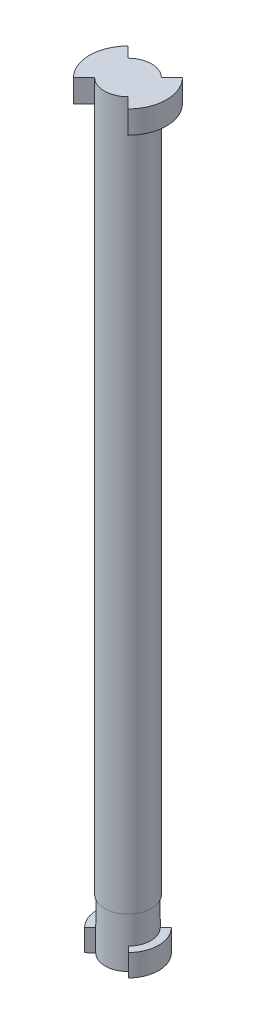
ISO-10303-21;
HEADER;
FILE_DESCRIPTION(('STEP AP214'),'2;1');
FILE_NAME('part.step','',(''),(''),'','','');
FILE_SCHEMA(('AUTOMOTIVE_DESIGN { 1 0 10303 214 1 1 1 1 }'));
ENDSEC;
DATA;
#1=APPLICATION_CONTEXT('core data for automotive mechanical design processes');
#2=APPLICATION_PROTOCOL_DEFINITION('international standard','automotive_design',2000,#1);
#3=PRODUCT_CONTEXT('',#1,'mechanical');
#4=PRODUCT('Part','Part','',(#3));
#5=PRODUCT_RELATED_PRODUCT_CATEGORY('part','',(#4));
#6=PRODUCT_DEFINITION_FORMATION('','',#4);
#7=PRODUCT_DEFINITION_CONTEXT('part definition',#1,'design');
#8=PRODUCT_DEFINITION('design','',#6,#7);
#9=PRODUCT_DEFINITION_SHAPE('','',#8);
#10=(LENGTH_UNIT() NAMED_UNIT(*) SI_UNIT(.MILLI.,.METRE.));
#11=(NAMED_UNIT(*) PLANE_ANGLE_UNIT() SI_UNIT($,.RADIAN.));
#12=(NAMED_UNIT(*) SI_UNIT($,.STERADIAN.) SOLID_ANGLE_UNIT());
#13=UNCERTAINTY_MEASURE_WITH_UNIT(LENGTH_MEASURE(1.E-05),#10,'distance_accuracy_value','');
#14=(GEOMETRIC_REPRESENTATION_CONTEXT(3) GLOBAL_UNCERTAINTY_ASSIGNED_CONTEXT((#13)) GLOBAL_UNIT_ASSIGNED_CONTEXT((#10,
#11,#12)) REPRESENTATION_CONTEXT('',''));
#15=CARTESIAN_POINT('',(0.,0.,0.));
#16=DIRECTION('',(0.,0.,1.));
#17=DIRECTION('',(1.,0.,0.));
#18=AXIS2_PLACEMENT_3D('',#15,#16,#17);
#19=CARTESIAN_POINT('',(0.,0.,0.));
#20=DIRECTION('',(0.,-1.,0.));
#21=DIRECTION('',(0.,0.,-1.));
#22=AXIS2_PLACEMENT_3D('',#19,#20,#21);
#23=CYLINDRICAL_SURFACE('',#22,3.81);
#24=CARTESIAN_POINT('',(0.,0.,0.));
#25=DIRECTION('',(0.,-1.,0.));
#26=DIRECTION('',(0.,0.,-1.));
#27=AXIS2_PLACEMENT_3D('',#24,#25,#26);
#28=CIRCLE('',#27,3.81);
#29=CARTESIAN_POINT('',(0.,0.,-3.81));
#30=VERTEX_POINT('',#29);
#31=EDGE_CURVE('E284',#30,#30,#28,.T.);
#32=ORIENTED_EDGE('',*,*,#31,.F.);
#33=EDGE_LOOP('',(#32));
#34=FACE_BOUND('',#33,.T.);
#35=CARTESIAN_POINT('',(0.,114.3,0.));
#36=DIRECTION('',(0.,-1.,0.));
#37=DIRECTION('',(0.,0.,-1.));
#38=AXIS2_PLACEMENT_3D('',#35,#36,#37);
#39=CIRCLE('',#38,3.81);
#40=CARTESIAN_POINT('',(-2.69407683632074,114.3,-2.69407683632075));
#41=VERTEX_POINT('',#40);
#42=CARTESIAN_POINT('',(2.69407683632074,114.3,-2.69407683632075));
#43=VERTEX_POINT('',#42);
#44=EDGE_CURVE('E292',#41,#43,#39,.T.);
#45=ORIENTED_EDGE('',*,*,#44,.T.);
#46=DIRECTION('',(0.,1.,0.));
#47=VECTOR('',#46,1.);
#48=CARTESIAN_POINT('',(2.69407683632074,0.,-2.69407683632075));
#49=LINE('',#48,#47);
#50=CARTESIAN_POINT('',(2.69407683632074,110.617,-2.69407683632075));
#51=VERTEX_POINT('',#50);
#52=EDGE_CURVE('E57',#51,#43,#49,.T.);
#53=ORIENTED_EDGE('',*,*,#52,.F.);
#54=CARTESIAN_POINT('',(0.,110.617,0.));
#55=DIRECTION('',(0.,-1.,0.));
#56=DIRECTION('',(0.,0.,-1.));
#57=AXIS2_PLACEMENT_3D('',#54,#55,#56);
#58=CIRCLE('',#57,3.81);
#59=CARTESIAN_POINT('',(2.69407683632074,110.617,2.69407683632075));
#60=VERTEX_POINT('',#59);
#61=EDGE_CURVE('E61',#51,#60,#58,.T.);
#62=ORIENTED_EDGE('',*,*,#61,.T.);
#63=DIRECTION('',(0.,1.,0.));
#64=VECTOR('',#63,1.);
#65=CARTESIAN_POINT('',(2.69407683632074,0.,2.69407683632075));
#66=LINE('',#65,#64);
#67=CARTESIAN_POINT('',(2.69407683632074,114.3,2.69407683632075));
#68=VERTEX_POINT('',#67);
#69=EDGE_CURVE('E180',#60,#68,#66,.T.);
#70=ORIENTED_EDGE('',*,*,#69,.T.);
#71=CARTESIAN_POINT('',(-2.69407683632074,114.3,2.69407683632075));
#72=VERTEX_POINT('',#71);
#73=EDGE_CURVE('E178',#68,#72,#39,.T.);
#74=ORIENTED_EDGE('',*,*,#73,.T.);
#75=DIRECTION('',(0.,1.,0.));
#76=VECTOR('',#75,1.);
#77=CARTESIAN_POINT('',(-2.69407683632074,0.,2.69407683632075));
#78=LINE('',#77,#76);
#79=CARTESIAN_POINT('',(-2.69407683632074,110.617,2.69407683632075));
#80=VERTEX_POINT('',#79);
#81=EDGE_CURVE('E218',#80,#72,#78,.T.);
#82=ORIENTED_EDGE('',*,*,#81,.F.);
#83=CARTESIAN_POINT('',(0.,110.617,0.));
#84=DIRECTION('',(0.,-1.,0.));
#85=DIRECTION('',(0.,0.,-1.));
#86=AXIS2_PLACEMENT_3D('',#83,#84,#85);
#87=CIRCLE('',#86,3.81);
#88=CARTESIAN_POINT('',(-2.69407683632074,110.617,-2.69407683632075));
#89=VERTEX_POINT('',#88);
#90=EDGE_CURVE('E234',#80,#89,#87,.T.);
#91=ORIENTED_EDGE('',*,*,#90,.T.);
#92=DIRECTION('',(0.,1.,0.));
#93=VECTOR('',#92,1.);
#94=CARTESIAN_POINT('',(-2.69407683632074,0.,-2.69407683632075));
#95=LINE('',#94,#93);
#96=EDGE_CURVE('E166',#89,#41,#95,.T.);
#97=ORIENTED_EDGE('',*,*,#96,.T.);
#98=EDGE_LOOP('',(#45,#53,#62,#70,#74,#82,#91,#97));
#99=FACE_BOUND('',#98,.T.);
#100=ADVANCED_FACE('F41',(#34,#99),#23,.T.);
#101=CARTESIAN_POINT('',(0.,-4.57200000000002,0.));
#102=DIRECTION('',(0.,-1.,0.));
#103=DIRECTION('',(1.,0.,0.));
#104=AXIS2_PLACEMENT_3D('',#101,#102,#103);
#105=PLANE('',#104);
#106=CARTESIAN_POINT('',(0.,-4.57200000000002,0.));
#107=DIRECTION('',(0.,1.,0.));
#108=DIRECTION('',(-1.,0.,0.));
#109=AXIS2_PLACEMENT_3D('',#106,#107,#108);
#110=CIRCLE('',#109,4.953);
#111=CARTESIAN_POINT('',(-3.53272947466064,-4.57200000000002,-3.47160358607717));
#112=VERTEX_POINT('',#111);
#113=CARTESIAN_POINT('',(-3.53272947466064,-4.57200000000002,3.47160358607716));
#114=VERTEX_POINT('',#113);
#115=EDGE_CURVE('E50',#112,#114,#110,.T.);
#116=ORIENTED_EDGE('',*,*,#115,.T.);
#117=DIRECTION('',(0.71325044915418,0.,-0.700909264299852));
#118=VECTOR('',#117,1.);
#119=CARTESIAN_POINT('',(0.,-4.57200000000002,0.));
#120=LINE('',#119,#118);
#121=CARTESIAN_POINT('',(-2.62690140423484,-4.57200000000002,2.58144882041636));
#122=VERTEX_POINT('',#121);
#123=EDGE_CURVE('E303',#114,#122,#120,.T.);
#124=ORIENTED_EDGE('',*,*,#123,.T.);
#125=CARTESIAN_POINT('',(0.,-4.57200000000002,0.));
#126=DIRECTION('',(0.,1.,0.));
#127=DIRECTION('',(-1.,0.,0.));
#128=AXIS2_PLACEMENT_3D('',#125,#126,#127);
#129=CIRCLE('',#128,3.68300000000001);
#130=CARTESIAN_POINT('',(-2.62690140423484,-4.57200000000002,-2.58144882041637));
#131=VERTEX_POINT('',#130);
#132=EDGE_CURVE('E11',#131,#122,#129,.T.);
#133=ORIENTED_EDGE('',*,*,#132,.F.);
#134=DIRECTION('',(0.71325044915418,0.,0.700909264299852));
#135=VECTOR('',#134,1.);
#136=CARTESIAN_POINT('',(0.,-4.57200000000002,0.));
#137=LINE('',#136,#135);
#138=EDGE_CURVE('E319',#112,#131,#137,.T.);
#139=ORIENTED_EDGE('',*,*,#138,.F.);
#140=EDGE_LOOP('',(#116,#124,#133,#139));
#141=FACE_BOUND('',#140,.T.);
#142=ADVANCED_FACE('F43',(#141),#105,.F.);
#143=CARTESIAN_POINT('',(0.,-6.35,0.));
#144=DIRECTION('',(0.,1.,0.));
#145=DIRECTION('',(-1.,0.,0.));
#146=AXIS2_PLACEMENT_3D('',#143,#144,#145);
#147=CYLINDRICAL_SURFACE('',#146,4.953);
#148=CARTESIAN_POINT('',(0.,-8.12800000000002,0.));
#149=DIRECTION('',(0.,1.,0.));
#150=DIRECTION('',(-1.,0.,0.));
#151=AXIS2_PLACEMENT_3D('',#148,#149,#150);
#152=CIRCLE('',#151,4.953);
#153=CARTESIAN_POINT('',(-3.53272947466064,-8.12800000000002,-3.47160358607717));
#154=VERTEX_POINT('',#153);
#155=CARTESIAN_POINT('',(-3.53272947466064,-8.12800000000002,3.47160358607716));
#156=VERTEX_POINT('',#155);
#157=EDGE_CURVE('E331',#154,#156,#152,.T.);
#158=ORIENTED_EDGE('',*,*,#157,.T.);
#159=DIRECTION('',(0.,-1.,0.));
#160=VECTOR('',#159,1.);
#161=CARTESIAN_POINT('',(-3.53272947466065,0.,3.47160358607716));
#162=LINE('',#161,#160);
#163=EDGE_CURVE('E307',#114,#156,#162,.T.);
#164=ORIENTED_EDGE('',*,*,#163,.F.);
#165=ORIENTED_EDGE('',*,*,#115,.F.);
#166=DIRECTION('',(0.,-1.,0.));
#167=VECTOR('',#166,1.);
#168=CARTESIAN_POINT('',(-3.53272947466064,0.,-3.47160358607717));
#169=LINE('',#168,#167);
#170=EDGE_CURVE('E323',#112,#154,#169,.T.);
#171=ORIENTED_EDGE('',*,*,#170,.T.);
#172=EDGE_LOOP('',(#158,#164,#165,#171));
#173=FACE_BOUND('',#172,.T.);
#174=ADVANCED_FACE('F343',(#173),#147,.T.);
#175=CARTESIAN_POINT('',(0.,-8.12800000000002,0.));
#176=DIRECTION('',(0.,1.,0.));
#177=DIRECTION('',(-1.,0.,0.));
#178=AXIS2_PLACEMENT_3D('',#175,#176,#177);
#179=PLANE('',#178);
#180=DIRECTION('',(-0.71325044915418,0.,-0.700909264299852));
#181=VECTOR('',#180,1.);
#182=CARTESIAN_POINT('',(0.,-8.12800000000002,0.));
#183=LINE('',#182,#181);
#184=CARTESIAN_POINT('',(-2.62690140423484,-8.12800000000002,-2.58144882041637));
#185=VERTEX_POINT('',#184);
#186=EDGE_CURVE('E327',#185,#154,#183,.T.);
#187=ORIENTED_EDGE('',*,*,#186,.F.);
#188=CARTESIAN_POINT('',(0.,-8.12800000000002,0.));
#189=DIRECTION('',(0.,1.,0.));
#190=DIRECTION('',(-1.,0.,0.));
#191=AXIS2_PLACEMENT_3D('',#188,#189,#190);
#192=CIRCLE('',#191,3.68299999999999);
#193=CARTESIAN_POINT('',(2.62690140423485,-8.12800000000002,-2.58144882041635));
#194=VERTEX_POINT('',#193);
#195=EDGE_CURVE('E295',#194,#185,#192,.T.);
#196=ORIENTED_EDGE('',*,*,#195,.F.);
#197=DIRECTION('',(0.71325044915418,0.,-0.700909264299852));
#198=VECTOR('',#197,1.);
#199=CARTESIAN_POINT('',(0.,-8.12800000000002,0.));
#200=LINE('',#199,#198);
#201=CARTESIAN_POINT('',(3.53272947466067,-8.12800000000002,-3.47160358607717));
#202=VERTEX_POINT('',#201);
#203=EDGE_CURVE('E247',#194,#202,#200,.T.);
#204=ORIENTED_EDGE('',*,*,#203,.T.);
#205=CARTESIAN_POINT('',(0.,-8.12800000000003,0.));
#206=DIRECTION('',(0.,1.,0.));
#207=DIRECTION('',(-1.,0.,0.));
#208=AXIS2_PLACEMENT_3D('',#205,#206,#207);
#209=CIRCLE('',#208,4.953);
#210=CARTESIAN_POINT('',(3.53272947466067,-8.12800000000002,3.47160358607717));
#211=VERTEX_POINT('',#210);
#212=EDGE_CURVE('E281',#211,#202,#209,.T.);
#213=ORIENTED_EDGE('',*,*,#212,.F.);
#214=DIRECTION('',(0.71325044915418,0.,0.700909264299852));
#215=VECTOR('',#214,1.);
#216=CARTESIAN_POINT('',(0.,-8.12800000000002,0.));
#217=LINE('',#216,#215);
#218=CARTESIAN_POINT('',(2.62690140423486,-8.12800000000002,2.58144882041634));
#219=VERTEX_POINT('',#218);
#220=EDGE_CURVE('E262',#219,#211,#217,.T.);
#221=ORIENTED_EDGE('',*,*,#220,.F.);
#222=CARTESIAN_POINT('',(-2.62690140423482,-8.12800000000003,2.58144882041634));
#223=VERTEX_POINT('',#222);
#224=EDGE_CURVE('E296',#223,#219,#192,.T.);
#225=ORIENTED_EDGE('',*,*,#224,.F.);
#226=DIRECTION('',(-0.71325044915418,0.,0.700909264299852));
#227=VECTOR('',#226,1.);
#228=CARTESIAN_POINT('',(0.,-8.12800000000002,0.));
#229=LINE('',#228,#227);
#230=EDGE_CURVE('E311',#223,#156,#229,.T.);
#231=ORIENTED_EDGE('',*,*,#230,.T.);
#232=ORIENTED_EDGE('',*,*,#157,.F.);
#233=EDGE_LOOP('',(#187,#196,#204,#213,#221,#225,#231,#232));
#234=FACE_BOUND('',#233,.T.);
#235=ADVANCED_FACE('F346',(#234),#179,.F.);
#236=CARTESIAN_POINT('',(0.,0.,0.));
#237=DIRECTION('',(-0.700909264299852,0.,0.71325044915418));
#238=DIRECTION('',(0.71325044915418,0.,0.700909264299852));
#239=AXIS2_PLACEMENT_3D('',#236,#237,#238);
#240=PLANE('',#239);
#241=DIRECTION('',(0.,-1.,0.));
#242=VECTOR('',#241,1.);
#243=CARTESIAN_POINT('',(-2.62690140423484,0.,-2.58144882041636));
#244=LINE('',#243,#242);
#245=EDGE_CURVE('E315',#131,#185,#244,.T.);
#246=ORIENTED_EDGE('',*,*,#245,.T.);
#247=ORIENTED_EDGE('',*,*,#186,.T.);
#248=ORIENTED_EDGE('',*,*,#170,.F.);
#249=ORIENTED_EDGE('',*,*,#138,.T.);
#250=EDGE_LOOP('',(#246,#247,#248,#249));
#251=FACE_BOUND('',#250,.T.);
#252=ADVANCED_FACE('F356',(#251),#240,.F.);
#253=CARTESIAN_POINT('',(0.,0.,0.));
#254=DIRECTION('',(0.700909264299852,0.,0.71325044915418));
#255=DIRECTION('',(0.71325044915418,0.,-0.700909264299852));
#256=AXIS2_PLACEMENT_3D('',#253,#254,#255);
#257=PLANE('',#256);
#258=DIRECTION('',(0.,-1.,0.));
#259=VECTOR('',#258,1.);
#260=CARTESIAN_POINT('',(-2.62690140423485,0.,2.58144882041636));
#261=LINE('',#260,#259);
#262=EDGE_CURVE('E300',#122,#223,#261,.T.);
#263=ORIENTED_EDGE('',*,*,#262,.F.);
#264=ORIENTED_EDGE('',*,*,#123,.F.);
#265=ORIENTED_EDGE('',*,*,#163,.T.);
#266=ORIENTED_EDGE('',*,*,#230,.F.);
#267=EDGE_LOOP('',(#263,#264,#265,#266));
#268=FACE_BOUND('',#267,.T.);
#269=ADVANCED_FACE('F341',(#268),#257,.T.);
#270=CARTESIAN_POINT('',(0.,-6.35,0.));
#271=DIRECTION('',(0.,1.,0.));
#272=DIRECTION('',(-1.,0.,0.));
#273=AXIS2_PLACEMENT_3D('',#270,#271,#272);
#274=CYLINDRICAL_SURFACE('',#273,3.68299999999999);
#275=DIRECTION('',(0.,-1.,0.));
#276=VECTOR('',#275,1.);
#277=CARTESIAN_POINT('',(2.62690140423485,0.,2.58144882041635));
#278=LINE('',#277,#276);
#279=CARTESIAN_POINT('',(2.62690140423485,-4.572,2.58144882041635));
#280=VERTEX_POINT('',#279);
#281=EDGE_CURVE('E259',#280,#219,#278,.T.);
#282=ORIENTED_EDGE('',*,*,#281,.F.);
#283=CARTESIAN_POINT('',(0.,-4.572,0.));
#284=DIRECTION('',(0.,1.,0.));
#285=DIRECTION('',(-1.,0.,0.));
#286=AXIS2_PLACEMENT_3D('',#283,#284,#285);
#287=CIRCLE('',#286,3.68299999999999);
#288=CARTESIAN_POINT('',(2.62690140423485,-4.572,-2.58144882041635));
#289=VERTEX_POINT('',#288);
#290=EDGE_CURVE('E274',#280,#289,#287,.T.);
#291=ORIENTED_EDGE('',*,*,#290,.T.);
#292=DIRECTION('',(0.,-1.,0.));
#293=VECTOR('',#292,1.);
#294=CARTESIAN_POINT('',(2.62690140423485,0.,-2.58144882041636));
#295=LINE('',#294,#293);
#296=EDGE_CURVE('E243',#289,#194,#295,.T.);
#297=ORIENTED_EDGE('',*,*,#296,.T.);
#298=ORIENTED_EDGE('',*,*,#195,.T.);
#299=ORIENTED_EDGE('',*,*,#245,.F.);
#300=ORIENTED_EDGE('',*,*,#132,.T.);
#301=ORIENTED_EDGE('',*,*,#262,.T.);
#302=ORIENTED_EDGE('',*,*,#224,.T.);
#303=EDGE_LOOP('',(#282,#291,#297,#298,#299,#300,#301,#302));
#304=FACE_BOUND('',#303,.T.);
#305=CARTESIAN_POINT('',(0.,0.,0.));
#306=DIRECTION('',(0.,-1.,0.));
#307=DIRECTION('',(0.,0.,-1.));
#308=AXIS2_PLACEMENT_3D('',#305,#306,#307);
#309=CIRCLE('',#308,3.683);
#310=CARTESIAN_POINT('',(0.,0.,-3.683));
#311=VERTEX_POINT('',#310);
#312=EDGE_CURVE('E288',#311,#311,#309,.T.);
#313=ORIENTED_EDGE('',*,*,#312,.T.);
#314=EDGE_LOOP('',(#313));
#315=FACE_BOUND('',#314,.T.);
#316=ADVANCED_FACE('F352',(#304,#315),#274,.T.);
#317=CARTESIAN_POINT('',(0.,114.3,0.));
#318=DIRECTION('',(0.,1.,0.));
#319=DIRECTION('',(0.,0.,1.));
#320=AXIS2_PLACEMENT_3D('',#317,#318,#319);
#321=PLANE('',#320);
#322=ORIENTED_EDGE('',*,*,#44,.F.);
#323=DIRECTION('',(-0.707106781186546,0.,-0.707106781186549));
#324=VECTOR('',#323,1.);
#325=CARTESIAN_POINT('',(-1.39449001264677E-12,114.3,-1.39449001264678E-12));
#326=LINE('',#325,#324);
#327=CARTESIAN_POINT('',(-4.40032549932388,114.3,-4.40032549932389));
#328=VERTEX_POINT('',#327);
#329=EDGE_CURVE('E206',#41,#328,#326,.T.);
#330=ORIENTED_EDGE('',*,*,#329,.T.);
#331=CARTESIAN_POINT('',(0.,114.3,0.));
#332=DIRECTION('',(0.,-1.,0.));
#333=DIRECTION('',(0.,0.,-1.));
#334=AXIS2_PLACEMENT_3D('',#331,#332,#333);
#335=CIRCLE('',#334,6.223);
#336=CARTESIAN_POINT('',(-4.40032549932388,114.3,4.40032549932389));
#337=VERTEX_POINT('',#336);
#338=EDGE_CURVE('E240',#337,#328,#335,.T.);
#339=ORIENTED_EDGE('',*,*,#338,.F.);
#340=DIRECTION('',(-0.707106781186546,0.,0.707106781186549));
#341=VECTOR('',#340,1.);
#342=CARTESIAN_POINT('',(-1.39449001264677E-12,114.3,1.39449001264678E-12));
#343=LINE('',#342,#341);
#344=EDGE_CURVE('E222',#72,#337,#343,.T.);
#345=ORIENTED_EDGE('',*,*,#344,.F.);
#346=ORIENTED_EDGE('',*,*,#73,.F.);
#347=DIRECTION('',(0.707106781186546,0.,0.707106781186549));
#348=VECTOR('',#347,1.);
#349=CARTESIAN_POINT('',(1.39449001264677E-12,114.3,1.39449001264678E-12));
#350=LINE('',#349,#348);
#351=CARTESIAN_POINT('',(4.40032549932388,114.3,4.40032549932389));
#352=VERTEX_POINT('',#351);
#353=EDGE_CURVE('E171',#68,#352,#350,.T.);
#354=ORIENTED_EDGE('',*,*,#353,.T.);
#355=CARTESIAN_POINT('',(0.,114.3,0.));
#356=DIRECTION('',(0.,-1.,0.));
#357=DIRECTION('',(0.,0.,-1.));
#358=AXIS2_PLACEMENT_3D('',#355,#356,#357);
#359=CIRCLE('',#358,6.223);
#360=CARTESIAN_POINT('',(4.40032549932388,114.3,-4.40032549932389));
#361=VERTEX_POINT('',#360);
#362=EDGE_CURVE('E154',#361,#352,#359,.T.);
#363=ORIENTED_EDGE('',*,*,#362,.F.);
#364=DIRECTION('',(0.707106781186546,0.,-0.707106781186549));
#365=VECTOR('',#364,1.);
#366=CARTESIAN_POINT('',(1.39449001264677E-12,114.3,-1.39449001264678E-12));
#367=LINE('',#366,#365);
#368=EDGE_CURVE('E189',#43,#361,#367,.T.);
#369=ORIENTED_EDGE('',*,*,#368,.F.);
#370=EDGE_LOOP('',(#322,#330,#339,#345,#346,#354,#363,#369));
#371=FACE_BOUND('',#370,.T.);
#372=ADVANCED_FACE('F176',(#371),#321,.T.);
#373=CARTESIAN_POINT('',(0.,0.,0.));
#374=DIRECTION('',(0.,-1.,0.));
#375=DIRECTION('',(0.,0.,-1.));
#376=AXIS2_PLACEMENT_3D('',#373,#374,#375);
#377=PLANE('',#376);
#378=ORIENTED_EDGE('',*,*,#31,.T.);
#379=EDGE_LOOP('',(#378));
#380=FACE_BOUND('',#379,.T.);
#381=ORIENTED_EDGE('',*,*,#312,.F.);
#382=EDGE_LOOP('',(#381));
#383=FACE_BOUND('',#382,.T.);
#384=ADVANCED_FACE('F379',(#380,#383),#377,.T.);
#385=CARTESIAN_POINT('',(0.,-6.35,0.));
#386=DIRECTION('',(0.,1.,0.));
#387=DIRECTION('',(-1.,0.,0.));
#388=AXIS2_PLACEMENT_3D('',#385,#386,#387);
#389=CYLINDRICAL_SURFACE('',#388,4.953);
#390=CARTESIAN_POINT('',(0.,-4.572,0.));
#391=DIRECTION('',(0.,1.,0.));
#392=DIRECTION('',(-1.,0.,0.));
#393=AXIS2_PLACEMENT_3D('',#390,#391,#392);
#394=CIRCLE('',#393,4.953);
#395=CARTESIAN_POINT('',(3.53272947466067,-4.572,3.47160358607717));
#396=VERTEX_POINT('',#395);
#397=CARTESIAN_POINT('',(3.53272947466067,-4.572,-3.47160358607717));
#398=VERTEX_POINT('',#397);
#399=EDGE_CURVE('E278',#396,#398,#394,.T.);
#400=ORIENTED_EDGE('',*,*,#399,.F.);
#401=DIRECTION('',(0.,-1.,0.));
#402=VECTOR('',#401,1.);
#403=CARTESIAN_POINT('',(3.53272947466067,0.,3.47160358607717));
#404=LINE('',#403,#402);
#405=EDGE_CURVE('E266',#396,#211,#404,.T.);
#406=ORIENTED_EDGE('',*,*,#405,.T.);
#407=ORIENTED_EDGE('',*,*,#212,.T.);
#408=DIRECTION('',(0.,-1.,0.));
#409=VECTOR('',#408,1.);
#410=CARTESIAN_POINT('',(3.53272947466067,0.,-3.47160358607718));
#411=LINE('',#410,#409);
#412=EDGE_CURVE('E251',#398,#202,#411,.T.);
#413=ORIENTED_EDGE('',*,*,#412,.F.);
#414=EDGE_LOOP('',(#400,#406,#407,#413));
#415=FACE_BOUND('',#414,.T.);
#416=ADVANCED_FACE('F383',(#415),#389,.T.);
#417=CARTESIAN_POINT('',(0.,-4.572,0.));
#418=DIRECTION('',(0.,1.,0.));
#419=DIRECTION('',(-1.,0.,0.));
#420=AXIS2_PLACEMENT_3D('',#417,#418,#419);
#421=PLANE('',#420);
#422=DIRECTION('',(0.71325044915418,0.,0.700909264299852));
#423=VECTOR('',#422,1.);
#424=CARTESIAN_POINT('',(0.,-4.572,0.));
#425=LINE('',#424,#423);
#426=EDGE_CURVE('E270',#280,#396,#425,.T.);
#427=ORIENTED_EDGE('',*,*,#426,.T.);
#428=ORIENTED_EDGE('',*,*,#399,.T.);
#429=DIRECTION('',(0.71325044915418,0.,-0.700909264299852));
#430=VECTOR('',#429,1.);
#431=CARTESIAN_POINT('',(0.,-4.572,0.));
#432=LINE('',#431,#430);
#433=EDGE_CURVE('E255',#289,#398,#432,.T.);
#434=ORIENTED_EDGE('',*,*,#433,.F.);
#435=ORIENTED_EDGE('',*,*,#290,.F.);
#436=EDGE_LOOP('',(#427,#428,#434,#435));
#437=FACE_BOUND('',#436,.T.);
#438=ADVANCED_FACE('F388',(#437),#421,.T.);
#439=CARTESIAN_POINT('',(0.,0.,0.));
#440=DIRECTION('',(-0.700909264299852,0.,0.71325044915418));
#441=DIRECTION('',(0.71325044915418,0.,0.700909264299852));
#442=AXIS2_PLACEMENT_3D('',#439,#440,#441);
#443=PLANE('',#442);
#444=ORIENTED_EDGE('',*,*,#281,.T.);
#445=ORIENTED_EDGE('',*,*,#220,.T.);
#446=ORIENTED_EDGE('',*,*,#405,.F.);
#447=ORIENTED_EDGE('',*,*,#426,.F.);
#448=EDGE_LOOP('',(#444,#445,#446,#447));
#449=FACE_BOUND('',#448,.T.);
#450=ADVANCED_FACE('F395',(#449),#443,.T.);
#451=CARTESIAN_POINT('',(0.,0.,0.));
#452=DIRECTION('',(0.700909264299852,0.,0.71325044915418));
#453=DIRECTION('',(0.71325044915418,0.,-0.700909264299852));
#454=AXIS2_PLACEMENT_3D('',#451,#452,#453);
#455=PLANE('',#454);
#456=ORIENTED_EDGE('',*,*,#296,.F.);
#457=ORIENTED_EDGE('',*,*,#433,.T.);
#458=ORIENTED_EDGE('',*,*,#412,.T.);
#459=ORIENTED_EDGE('',*,*,#203,.F.);
#460=EDGE_LOOP('',(#456,#457,#458,#459));
#461=FACE_BOUND('',#460,.T.);
#462=ADVANCED_FACE('F399',(#461),#455,.F.);
#463=CARTESIAN_POINT('',(0.,0.,0.));
#464=DIRECTION('',(0.,-1.,0.));
#465=DIRECTION('',(0.,0.,-1.));
#466=AXIS2_PLACEMENT_3D('',#463,#464,#465);
#467=CYLINDRICAL_SURFACE('',#466,6.223);
#468=CARTESIAN_POINT('',(0.,110.617,0.));
#469=DIRECTION('',(0.,-1.,0.));
#470=DIRECTION('',(0.,0.,-1.));
#471=AXIS2_PLACEMENT_3D('',#468,#469,#470);
#472=CIRCLE('',#471,6.223);
#473=CARTESIAN_POINT('',(-4.40032549932388,110.617,4.40032549932389));
#474=VERTEX_POINT('',#473);
#475=CARTESIAN_POINT('',(-4.40032549932388,110.617,-4.40032549932389));
#476=VERTEX_POINT('',#475);
#477=EDGE_CURVE('E237',#474,#476,#472,.T.);
#478=ORIENTED_EDGE('',*,*,#477,.F.);
#479=DIRECTION('',(0.,-1.,0.));
#480=VECTOR('',#479,1.);
#481=CARTESIAN_POINT('',(-4.40032549932388,0.,4.40032549932389));
#482=LINE('',#481,#480);
#483=EDGE_CURVE('E226',#337,#474,#482,.T.);
#484=ORIENTED_EDGE('',*,*,#483,.F.);
#485=ORIENTED_EDGE('',*,*,#338,.T.);
#486=DIRECTION('',(0.,-1.,0.));
#487=VECTOR('',#486,1.);
#488=CARTESIAN_POINT('',(-4.40032549932388,0.,-4.40032549932389));
#489=LINE('',#488,#487);
#490=EDGE_CURVE('E210',#328,#476,#489,.T.);
#491=ORIENTED_EDGE('',*,*,#490,.T.);
#492=EDGE_LOOP('',(#478,#484,#485,#491));
#493=FACE_BOUND('',#492,.T.);
#494=ADVANCED_FACE('F403',(#493),#467,.T.);
#495=CARTESIAN_POINT('',(0.,110.617,0.));
#496=DIRECTION('',(0.,1.,0.));
#497=DIRECTION('',(0.,0.,1.));
#498=AXIS2_PLACEMENT_3D('',#495,#496,#497);
#499=PLANE('',#498);
#500=DIRECTION('',(0.707106781186546,0.,-0.707106781186549));
#501=VECTOR('',#500,1.);
#502=CARTESIAN_POINT('',(0.,110.617,0.));
#503=LINE('',#502,#501);
#504=EDGE_CURVE('E230',#474,#80,#503,.T.);
#505=ORIENTED_EDGE('',*,*,#504,.F.);
#506=ORIENTED_EDGE('',*,*,#477,.T.);
#507=DIRECTION('',(0.707106781186546,0.,0.707106781186549));
#508=VECTOR('',#507,1.);
#509=CARTESIAN_POINT('',(0.,110.617,0.));
#510=LINE('',#509,#508);
#511=EDGE_CURVE('E214',#476,#89,#510,.T.);
#512=ORIENTED_EDGE('',*,*,#511,.T.);
#513=ORIENTED_EDGE('',*,*,#90,.F.);
#514=EDGE_LOOP('',(#505,#506,#512,#513));
#515=FACE_BOUND('',#514,.T.);
#516=ADVANCED_FACE('F407',(#515),#499,.F.);
#517=CARTESIAN_POINT('',(0.,0.,0.));
#518=DIRECTION('',(0.707106781186549,0.,0.707106781186546));
#519=DIRECTION('',(0.707106781186546,0.,-0.707106781186549));
#520=AXIS2_PLACEMENT_3D('',#517,#518,#519);
#521=PLANE('',#520);
#522=ORIENTED_EDGE('',*,*,#81,.T.);
#523=ORIENTED_EDGE('',*,*,#344,.T.);
#524=ORIENTED_EDGE('',*,*,#483,.T.);
#525=ORIENTED_EDGE('',*,*,#504,.T.);
#526=EDGE_LOOP('',(#522,#523,#524,#525));
#527=FACE_BOUND('',#526,.T.);
#528=ADVANCED_FACE('F411',(#527),#521,.T.);
#529=CARTESIAN_POINT('',(0.,0.,0.));
#530=DIRECTION('',(-0.707106781186549,0.,0.707106781186546));
#531=DIRECTION('',(0.707106781186546,0.,0.707106781186549));
#532=AXIS2_PLACEMENT_3D('',#529,#530,#531);
#533=PLANE('',#532);
#534=ORIENTED_EDGE('',*,*,#96,.F.);
#535=ORIENTED_EDGE('',*,*,#511,.F.);
#536=ORIENTED_EDGE('',*,*,#490,.F.);
#537=ORIENTED_EDGE('',*,*,#329,.F.);
#538=EDGE_LOOP('',(#534,#535,#536,#537));
#539=FACE_BOUND('',#538,.T.);
#540=ADVANCED_FACE('F415',(#539),#533,.F.);
#541=CARTESIAN_POINT('',(0.,0.,0.));
#542=DIRECTION('',(0.,-1.,0.));
#543=DIRECTION('',(0.,0.,-1.));
#544=AXIS2_PLACEMENT_3D('',#541,#542,#543);
#545=CYLINDRICAL_SURFACE('',#544,6.223);
#546=ORIENTED_EDGE('',*,*,#362,.T.);
#547=DIRECTION('',(0.,-1.,0.));
#548=VECTOR('',#547,1.);
#549=CARTESIAN_POINT('',(4.40032549932388,0.,4.40032549932389));
#550=LINE('',#549,#548);
#551=CARTESIAN_POINT('',(4.40032549932388,110.617,4.40032549932389));
#552=VERTEX_POINT('',#551);
#553=EDGE_CURVE('E157',#352,#552,#550,.T.);
#554=ORIENTED_EDGE('',*,*,#553,.T.);
#555=CARTESIAN_POINT('',(0.,110.617,0.));
#556=DIRECTION('',(0.,-1.,0.));
#557=DIRECTION('',(0.,0.,-1.));
#558=AXIS2_PLACEMENT_3D('',#555,#556,#557);
#559=CIRCLE('',#558,6.223);
#560=CARTESIAN_POINT('',(4.40032549932388,110.617,-4.40032549932389));
#561=VERTEX_POINT('',#560);
#562=EDGE_CURVE('E198',#561,#552,#559,.T.);
#563=ORIENTED_EDGE('',*,*,#562,.F.);
#564=DIRECTION('',(0.,-1.,0.));
#565=VECTOR('',#564,1.);
#566=CARTESIAN_POINT('',(4.40032549932388,0.,-4.40032549932389));
#567=LINE('',#566,#565);
#568=EDGE_CURVE('E160',#361,#561,#567,.T.);
#569=ORIENTED_EDGE('',*,*,#568,.F.);
#570=EDGE_LOOP('',(#546,#554,#563,#569));
#571=FACE_BOUND('',#570,.T.);
#572=ADVANCED_FACE('F156',(#571),#545,.T.);
#573=CARTESIAN_POINT('',(0.,110.617,0.));
#574=DIRECTION('',(0.,1.,0.));
#575=DIRECTION('',(0.,0.,1.));
#576=AXIS2_PLACEMENT_3D('',#573,#574,#575);
#577=PLANE('',#576);
#578=DIRECTION('',(-0.707106781186546,0.,0.707106781186549));
#579=VECTOR('',#578,1.);
#580=CARTESIAN_POINT('',(0.,110.617,0.));
#581=LINE('',#580,#579);
#582=EDGE_CURVE('E194',#561,#51,#581,.T.);
#583=ORIENTED_EDGE('',*,*,#582,.F.);
#584=ORIENTED_EDGE('',*,*,#562,.T.);
#585=DIRECTION('',(-0.707106781186546,0.,-0.707106781186549));
#586=VECTOR('',#585,1.);
#587=CARTESIAN_POINT('',(0.,110.617,0.));
#588=LINE('',#587,#586);
#589=EDGE_CURVE('E173',#552,#60,#588,.T.);
#590=ORIENTED_EDGE('',*,*,#589,.T.);
#591=ORIENTED_EDGE('',*,*,#61,.F.);
#592=EDGE_LOOP('',(#583,#584,#590,#591));
#593=FACE_BOUND('',#592,.T.);
#594=ADVANCED_FACE('F420',(#593),#577,.F.);
#595=CARTESIAN_POINT('',(0.,0.,0.));
#596=DIRECTION('',(0.707106781186549,0.,0.707106781186546));
#597=DIRECTION('',(0.707106781186546,0.,-0.707106781186549));
#598=AXIS2_PLACEMENT_3D('',#595,#596,#597);
#599=PLANE('',#598);
#600=ORIENTED_EDGE('',*,*,#568,.T.);
#601=ORIENTED_EDGE('',*,*,#582,.T.);
#602=ORIENTED_EDGE('',*,*,#52,.T.);
#603=ORIENTED_EDGE('',*,*,#368,.T.);
#604=EDGE_LOOP('',(#600,#601,#602,#603));
#605=FACE_BOUND('',#604,.T.);
#606=ADVANCED_FACE('F423',(#605),#599,.F.);
#607=CARTESIAN_POINT('',(0.,0.,0.));
#608=DIRECTION('',(-0.707106781186549,0.,0.707106781186546));
#609=DIRECTION('',(0.707106781186546,0.,0.707106781186549));
#610=AXIS2_PLACEMENT_3D('',#607,#608,#609);
#611=PLANE('',#610);
#612=ORIENTED_EDGE('',*,*,#553,.F.);
#613=ORIENTED_EDGE('',*,*,#353,.F.);
#614=ORIENTED_EDGE('',*,*,#69,.F.);
#615=ORIENTED_EDGE('',*,*,#589,.F.);
#616=EDGE_LOOP('',(#612,#613,#614,#615));
#617=FACE_BOUND('',#616,.T.);
#618=ADVANCED_FACE('F170',(#617),#611,.T.);
#619=CLOSED_SHELL('',(#100,#142,#174,#235,#252,#269,#316,#372,#384,#416,#438,#450,#462,#494,
#516,#528,#540,#572,#594,#606,#618));
#620=MANIFOLD_SOLID_BREP('B2',#619);
#621=ADVANCED_BREP_SHAPE_REPRESENTATION('',(#18,#620),#14);
#622=SHAPE_DEFINITION_REPRESENTATION(#9,#621);
ENDSEC;
END-ISO-10303-21;
